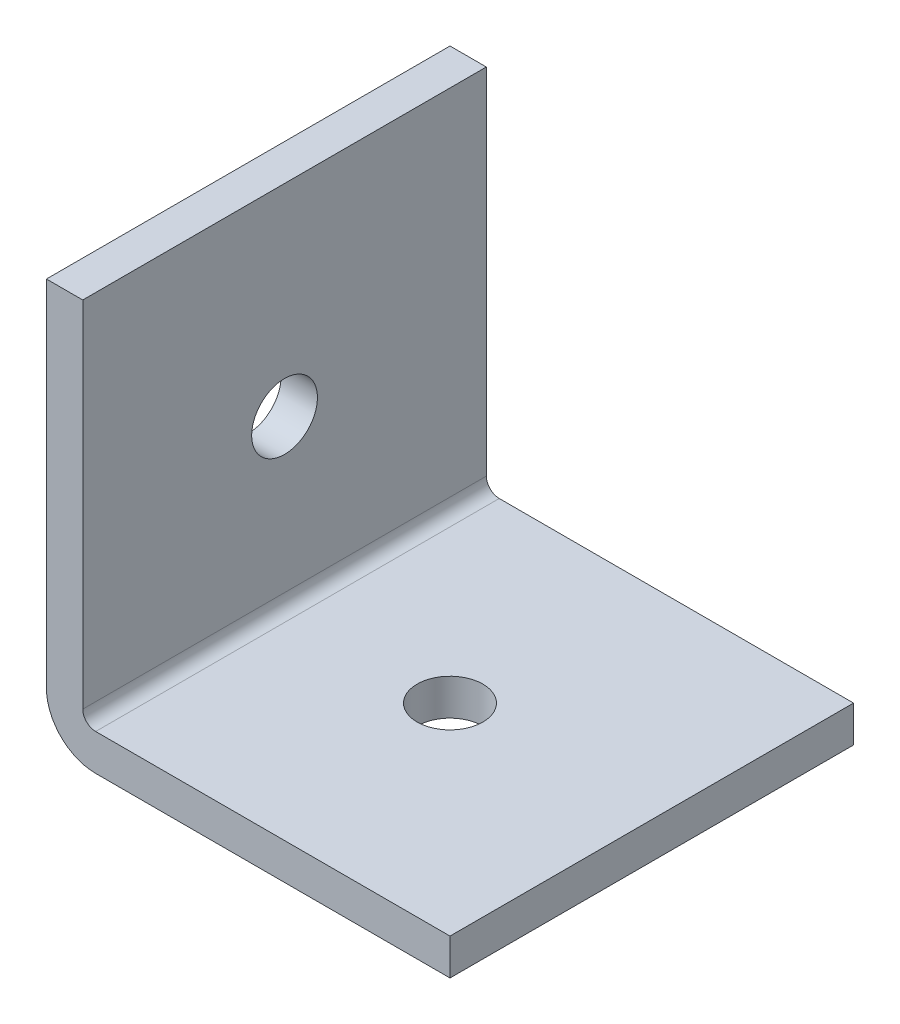
ISO-10303-21;
HEADER;
FILE_DESCRIPTION(('STEP AP214'),'2;1');
FILE_NAME('part.step','',(''),(''),'','','');
FILE_SCHEMA(('AUTOMOTIVE_DESIGN { 1 0 10303 214 1 1 1 1 }'));
ENDSEC;
DATA;
#1=APPLICATION_CONTEXT('core data for automotive mechanical design processes');
#2=APPLICATION_PROTOCOL_DEFINITION('international standard','automotive_design',2000,#1);
#3=PRODUCT_CONTEXT('',#1,'mechanical');
#4=PRODUCT('Part','Part','',(#3));
#5=PRODUCT_RELATED_PRODUCT_CATEGORY('part','',(#4));
#6=PRODUCT_DEFINITION_FORMATION('','',#4);
#7=PRODUCT_DEFINITION_CONTEXT('part definition',#1,'design');
#8=PRODUCT_DEFINITION('design','',#6,#7);
#9=PRODUCT_DEFINITION_SHAPE('','',#8);
#10=(LENGTH_UNIT() NAMED_UNIT(*) SI_UNIT(.MILLI.,.METRE.));
#11=(NAMED_UNIT(*) PLANE_ANGLE_UNIT() SI_UNIT($,.RADIAN.));
#12=(NAMED_UNIT(*) SI_UNIT($,.STERADIAN.) SOLID_ANGLE_UNIT());
#13=UNCERTAINTY_MEASURE_WITH_UNIT(LENGTH_MEASURE(1.E-05),#10,'distance_accuracy_value','');
#14=(GEOMETRIC_REPRESENTATION_CONTEXT(3) GLOBAL_UNCERTAINTY_ASSIGNED_CONTEXT((#13)) GLOBAL_UNIT_ASSIGNED_CONTEXT((#10,
#11,#12)) REPRESENTATION_CONTEXT('',''));
#15=CARTESIAN_POINT('',(0.,0.,0.));
#16=DIRECTION('',(0.,0.,1.));
#17=DIRECTION('',(1.,0.,0.));
#18=AXIS2_PLACEMENT_3D('',#15,#16,#17);
#19=CARTESIAN_POINT('',(25.4,0.,-749.3));
#20=DIRECTION('',(0.,-1.,0.));
#21=DIRECTION('',(0.,0.,-1.));
#22=AXIS2_PLACEMENT_3D('',#19,#20,#21);
#23=PLANE('',#22);
#24=DIRECTION('',(1.,0.,0.));
#25=VECTOR('',#24,1.);
#26=CARTESIAN_POINT('',(25.4,0.,-647.7));
#27=LINE('',#26,#25);
#28=CARTESIAN_POINT('',(3.0988,0.,-647.7));
#29=VERTEX_POINT('',#28);
#30=CARTESIAN_POINT('',(25.4,0.,-647.7));
#31=VERTEX_POINT('',#30);
#32=EDGE_CURVE('E99',#29,#31,#27,.T.);
#33=ORIENTED_EDGE('',*,*,#32,.F.);
#34=DIRECTION('',(0.,0.,1.));
#35=VECTOR('',#34,1.);
#36=CARTESIAN_POINT('',(3.0988,0.,-749.3));
#37=LINE('',#36,#35);
#38=CARTESIAN_POINT('',(3.0988,0.,-673.1));
#39=VERTEX_POINT('',#38);
#40=EDGE_CURVE('E57',#29,#39,#37,.F.);
#41=ORIENTED_EDGE('',*,*,#40,.T.);
#42=DIRECTION('',(1.,0.,0.));
#43=VECTOR('',#42,1.);
#44=CARTESIAN_POINT('',(25.4,0.,-673.1));
#45=LINE('',#44,#43);
#46=CARTESIAN_POINT('',(25.4,0.,-673.1));
#47=VERTEX_POINT('',#46);
#48=EDGE_CURVE('E150',#39,#47,#45,.T.);
#49=ORIENTED_EDGE('',*,*,#48,.T.);
#50=DIRECTION('',(0.,0.,1.));
#51=VECTOR('',#50,1.);
#52=CARTESIAN_POINT('',(25.4,0.,-749.3));
#53=LINE('',#52,#51);
#54=EDGE_CURVE('E107',#47,#31,#53,.T.);
#55=ORIENTED_EDGE('',*,*,#54,.T.);
#56=EDGE_LOOP('',(#33,#41,#49,#55));
#57=FACE_BOUND('',#56,.T.);
#58=CARTESIAN_POINT('',(12.7,0.,-660.4));
#59=DIRECTION('',(0.,-1.,0.));
#60=DIRECTION('',(0.,0.,-1.));
#61=AXIS2_PLACEMENT_3D('',#58,#59,#60);
#62=CIRCLE('',#61,2.07009999999995);
#63=CARTESIAN_POINT('',(12.7,0.,-662.4701));
#64=VERTEX_POINT('',#63);
#65=EDGE_CURVE('E131',#64,#64,#62,.T.);
#66=ORIENTED_EDGE('',*,*,#65,.F.);
#67=EDGE_LOOP('',(#66));
#68=FACE_BOUND('',#67,.T.);
#69=ADVANCED_FACE('F35',(#57,#68),#23,.T.);
#70=CARTESIAN_POINT('',(25.4,25.4,749.3));
#71=DIRECTION('',(0.,1.,0.));
#72=DIRECTION('',(0.,0.,1.));
#73=AXIS2_PLACEMENT_3D('',#70,#71,#72);
#74=PLANE('',#73);
#75=DIRECTION('',(-1.,0.,0.));
#76=VECTOR('',#75,1.);
#77=CARTESIAN_POINT('',(25.4,25.4,-647.7));
#78=LINE('',#77,#76);
#79=CARTESIAN_POINT('',(2.286,25.4,-647.7));
#80=VERTEX_POINT('',#79);
#81=CARTESIAN_POINT('',(0.,25.4000000000002,-647.7));
#82=VERTEX_POINT('',#81);
#83=EDGE_CURVE('E109',#80,#82,#78,.T.);
#84=ORIENTED_EDGE('',*,*,#83,.F.);
#85=DIRECTION('',(0.,0.,-1.));
#86=VECTOR('',#85,1.);
#87=CARTESIAN_POINT('',(2.286,25.4,749.3));
#88=LINE('',#87,#86);
#89=CARTESIAN_POINT('',(2.286,25.4,-673.1));
#90=VERTEX_POINT('',#89);
#91=EDGE_CURVE('E123',#80,#90,#88,.T.);
#92=ORIENTED_EDGE('',*,*,#91,.T.);
#93=DIRECTION('',(-1.,0.,0.));
#94=VECTOR('',#93,1.);
#95=CARTESIAN_POINT('',(25.4,25.4,-673.1));
#96=LINE('',#95,#94);
#97=CARTESIAN_POINT('',(0.,25.4000000000002,-673.1));
#98=VERTEX_POINT('',#97);
#99=EDGE_CURVE('E152',#90,#98,#96,.T.);
#100=ORIENTED_EDGE('',*,*,#99,.T.);
#101=DIRECTION('',(0.,0.,-1.));
#102=VECTOR('',#101,1.);
#103=CARTESIAN_POINT('',(0.,25.4,749.3));
#104=LINE('',#103,#102);
#105=EDGE_CURVE('E121',#82,#98,#104,.T.);
#106=ORIENTED_EDGE('',*,*,#105,.F.);
#107=EDGE_LOOP('',(#84,#92,#100,#106));
#108=FACE_BOUND('',#107,.T.);
#109=ADVANCED_FACE('F177',(#108),#74,.T.);
#110=CARTESIAN_POINT('',(25.4,0.,0.));
#111=DIRECTION('',(-1.,0.,0.));
#112=DIRECTION('',(0.,0.,1.));
#113=AXIS2_PLACEMENT_3D('',#110,#111,#112);
#114=PLANE('',#113);
#115=DIRECTION('',(0.,0.,-1.));
#116=VECTOR('',#115,1.);
#117=CARTESIAN_POINT('',(25.4,2.286,749.3));
#118=LINE('',#117,#116);
#119=CARTESIAN_POINT('',(25.4,2.286,-647.7));
#120=VERTEX_POINT('',#119);
#121=CARTESIAN_POINT('',(25.4,2.286,-673.1));
#122=VERTEX_POINT('',#121);
#123=EDGE_CURVE('E125',#120,#122,#118,.T.);
#124=ORIENTED_EDGE('',*,*,#123,.F.);
#125=DIRECTION('',(0.,-1.,0.));
#126=VECTOR('',#125,1.);
#127=CARTESIAN_POINT('',(25.4,0.,-647.7));
#128=LINE('',#127,#126);
#129=EDGE_CURVE('E164',#120,#31,#128,.T.);
#130=ORIENTED_EDGE('',*,*,#129,.T.);
#131=ORIENTED_EDGE('',*,*,#54,.F.);
#132=DIRECTION('',(0.,-1.,0.));
#133=VECTOR('',#132,1.);
#134=CARTESIAN_POINT('',(25.4,0.,-673.1));
#135=LINE('',#134,#133);
#136=EDGE_CURVE('E145',#122,#47,#135,.T.);
#137=ORIENTED_EDGE('',*,*,#136,.F.);
#138=EDGE_LOOP('',(#124,#130,#131,#137));
#139=FACE_BOUND('',#138,.T.);
#140=ADVANCED_FACE('F195',(#139),#114,.F.);
#141=CARTESIAN_POINT('',(0.,0.,0.));
#142=DIRECTION('',(-1.,0.,0.));
#143=DIRECTION('',(0.,0.,1.));
#144=AXIS2_PLACEMENT_3D('',#141,#142,#143);
#145=PLANE('',#144);
#146=DIRECTION('',(0.,-1.,0.));
#147=VECTOR('',#146,1.);
#148=CARTESIAN_POINT('',(0.,0.,-647.7));
#149=LINE('',#148,#147);
#150=CARTESIAN_POINT('',(0.,3.0988,-647.7));
#151=VERTEX_POINT('',#150);
#152=EDGE_CURVE('E49',#82,#151,#149,.T.);
#153=ORIENTED_EDGE('',*,*,#152,.F.);
#154=ORIENTED_EDGE('',*,*,#105,.T.);
#155=DIRECTION('',(0.,-1.,0.));
#156=VECTOR('',#155,1.);
#157=CARTESIAN_POINT('',(0.,0.,-673.1));
#158=LINE('',#157,#156);
#159=CARTESIAN_POINT('',(0.,3.0988,-673.1));
#160=VERTEX_POINT('',#159);
#161=EDGE_CURVE('E155',#98,#160,#158,.T.);
#162=ORIENTED_EDGE('',*,*,#161,.T.);
#163=DIRECTION('',(0.,0.,1.));
#164=VECTOR('',#163,1.);
#165=CARTESIAN_POINT('',(0.,3.0988,0.));
#166=LINE('',#165,#164);
#167=EDGE_CURVE('E112',#160,#151,#166,.T.);
#168=ORIENTED_EDGE('',*,*,#167,.T.);
#169=EDGE_LOOP('',(#153,#154,#162,#168));
#170=FACE_BOUND('',#169,.T.);
#171=CARTESIAN_POINT('',(0.,12.7,-660.4));
#172=DIRECTION('',(-1.,0.,0.));
#173=DIRECTION('',(0.,0.,1.));
#174=AXIS2_PLACEMENT_3D('',#171,#172,#173);
#175=CIRCLE('',#174,2.07009999999995);
#176=CARTESIAN_POINT('',(0.,12.7,-658.3299));
#177=VERTEX_POINT('',#176);
#178=EDGE_CURVE('E137',#177,#177,#175,.T.);
#179=ORIENTED_EDGE('',*,*,#178,.F.);
#180=EDGE_LOOP('',(#179));
#181=FACE_BOUND('',#180,.T.);
#182=ADVANCED_FACE('F174',(#170,#181),#145,.T.);
#183=CARTESIAN_POINT('',(2.286,2.286,749.3));
#184=DIRECTION('',(-1.,0.,0.));
#185=DIRECTION('',(0.,0.,1.));
#186=AXIS2_PLACEMENT_3D('',#183,#184,#185);
#187=PLANE('',#186);
#188=CARTESIAN_POINT('',(2.286,12.7,-660.4));
#189=DIRECTION('',(-1.,0.,0.));
#190=DIRECTION('',(0.,0.,1.));
#191=AXIS2_PLACEMENT_3D('',#188,#189,#190);
#192=CIRCLE('',#191,2.07009999999995);
#193=CARTESIAN_POINT('',(2.286,12.7,-658.3299));
#194=VERTEX_POINT('',#193);
#195=EDGE_CURVE('E134',#194,#194,#192,.T.);
#196=ORIENTED_EDGE('',*,*,#195,.T.);
#197=EDGE_LOOP('',(#196));
#198=FACE_BOUND('',#197,.T.);
#199=ORIENTED_EDGE('',*,*,#91,.F.);
#200=DIRECTION('',(0.,-1.,0.));
#201=VECTOR('',#200,1.);
#202=CARTESIAN_POINT('',(2.286,2.286,-647.7));
#203=LINE('',#202,#201);
#204=CARTESIAN_POINT('',(2.286,3.0988,-647.7));
#205=VERTEX_POINT('',#204);
#206=EDGE_CURVE('E108',#80,#205,#203,.T.);
#207=ORIENTED_EDGE('',*,*,#206,.T.);
#208=DIRECTION('',(0.,0.,-1.));
#209=VECTOR('',#208,1.);
#210=CARTESIAN_POINT('',(2.286,3.0988,-749.3));
#211=LINE('',#210,#209);
#212=CARTESIAN_POINT('',(2.286,3.0988,-673.1));
#213=VERTEX_POINT('',#212);
#214=EDGE_CURVE('E119',#205,#213,#211,.T.);
#215=ORIENTED_EDGE('',*,*,#214,.T.);
#216=DIRECTION('',(0.,-1.,0.));
#217=VECTOR('',#216,1.);
#218=CARTESIAN_POINT('',(2.286,2.286,-673.1));
#219=LINE('',#218,#217);
#220=EDGE_CURVE('E147',#90,#213,#219,.T.);
#221=ORIENTED_EDGE('',*,*,#220,.F.);
#222=EDGE_LOOP('',(#199,#207,#215,#221));
#223=FACE_BOUND('',#222,.T.);
#224=ADVANCED_FACE('F184',(#198,#223),#187,.F.);
#225=CARTESIAN_POINT('',(25.4,2.286,749.3));
#226=DIRECTION('',(0.,-1.,0.));
#227=DIRECTION('',(0.,0.,-1.));
#228=AXIS2_PLACEMENT_3D('',#225,#226,#227);
#229=PLANE('',#228);
#230=CARTESIAN_POINT('',(12.7,2.286,-660.4));
#231=DIRECTION('',(0.,-1.,0.));
#232=DIRECTION('',(0.,0.,-1.));
#233=AXIS2_PLACEMENT_3D('',#230,#231,#232);
#234=CIRCLE('',#233,2.07009999999995);
#235=CARTESIAN_POINT('',(12.7,2.286,-662.4701));
#236=VERTEX_POINT('',#235);
#237=EDGE_CURVE('E127',#236,#236,#234,.T.);
#238=ORIENTED_EDGE('',*,*,#237,.T.);
#239=EDGE_LOOP('',(#238));
#240=FACE_BOUND('',#239,.T.);
#241=DIRECTION('',(0.,0.,-1.));
#242=VECTOR('',#241,1.);
#243=CARTESIAN_POINT('',(3.0988,2.286,749.3));
#244=LINE('',#243,#242);
#245=CARTESIAN_POINT('',(3.0988,2.286,-673.1));
#246=VERTEX_POINT('',#245);
#247=CARTESIAN_POINT('',(3.0988,2.286,-647.7));
#248=VERTEX_POINT('',#247);
#249=EDGE_CURVE('E114',#246,#248,#244,.F.);
#250=ORIENTED_EDGE('',*,*,#249,.T.);
#251=DIRECTION('',(1.,0.,0.));
#252=VECTOR('',#251,1.);
#253=CARTESIAN_POINT('',(25.4,2.286,-647.7));
#254=LINE('',#253,#252);
#255=EDGE_CURVE('E158',#248,#120,#254,.T.);
#256=ORIENTED_EDGE('',*,*,#255,.T.);
#257=ORIENTED_EDGE('',*,*,#123,.T.);
#258=DIRECTION('',(1.,0.,0.));
#259=VECTOR('',#258,1.);
#260=CARTESIAN_POINT('',(25.4,2.286,-673.1));
#261=LINE('',#260,#259);
#262=EDGE_CURVE('E140',#246,#122,#261,.T.);
#263=ORIENTED_EDGE('',*,*,#262,.F.);
#264=EDGE_LOOP('',(#250,#256,#257,#263));
#265=FACE_BOUND('',#264,.T.);
#266=ADVANCED_FACE('F192',(#240,#265),#229,.F.);
#267=CARTESIAN_POINT('',(3.0988,3.0988,749.3));
#268=DIRECTION('',(0.,0.,1.));
#269=DIRECTION('',(1.,0.,0.));
#270=AXIS2_PLACEMENT_3D('',#267,#268,#269);
#271=CYLINDRICAL_SURFACE('',#270,0.8128);
#272=ORIENTED_EDGE('',*,*,#214,.F.);
#273=CARTESIAN_POINT('',(3.0988,3.0988,-647.7));
#274=DIRECTION('',(0.,0.,-1.));
#275=DIRECTION('',(-1.,0.,0.));
#276=AXIS2_PLACEMENT_3D('',#273,#274,#275);
#277=CIRCLE('',#276,0.8128);
#278=EDGE_CURVE('E161',#205,#248,#277,.F.);
#279=ORIENTED_EDGE('',*,*,#278,.T.);
#280=ORIENTED_EDGE('',*,*,#249,.F.);
#281=CARTESIAN_POINT('',(3.0988,3.0988,-673.1));
#282=DIRECTION('',(0.,0.,-1.));
#283=DIRECTION('',(-1.,0.,0.));
#284=AXIS2_PLACEMENT_3D('',#281,#282,#283);
#285=CIRCLE('',#284,0.8128);
#286=EDGE_CURVE('E143',#213,#246,#285,.F.);
#287=ORIENTED_EDGE('',*,*,#286,.F.);
#288=EDGE_LOOP('',(#272,#279,#280,#287));
#289=FACE_BOUND('',#288,.T.);
#290=ADVANCED_FACE('F187',(#289),#271,.F.);
#291=CARTESIAN_POINT('',(3.0988,3.0988,0.));
#292=DIRECTION('',(0.,0.,1.));
#293=DIRECTION('',(1.,0.,0.));
#294=AXIS2_PLACEMENT_3D('',#291,#292,#293);
#295=CYLINDRICAL_SURFACE('',#294,3.0988);
#296=CARTESIAN_POINT('',(3.0988,3.0988,-647.7));
#297=DIRECTION('',(0.,0.,-1.));
#298=DIRECTION('',(-1.,0.,0.));
#299=AXIS2_PLACEMENT_3D('',#296,#297,#298);
#300=CIRCLE('',#299,3.0988);
#301=EDGE_CURVE('E11',#151,#29,#300,.F.);
#302=ORIENTED_EDGE('',*,*,#301,.F.);
#303=ORIENTED_EDGE('',*,*,#167,.F.);
#304=CARTESIAN_POINT('',(3.0988,3.0988,-673.1));
#305=DIRECTION('',(0.,0.,-1.));
#306=DIRECTION('',(-1.,0.,0.));
#307=AXIS2_PLACEMENT_3D('',#304,#305,#306);
#308=CIRCLE('',#307,3.0988);
#309=EDGE_CURVE('E43',#160,#39,#308,.F.);
#310=ORIENTED_EDGE('',*,*,#309,.T.);
#311=ORIENTED_EDGE('',*,*,#40,.F.);
#312=EDGE_LOOP('',(#302,#303,#310,#311));
#313=FACE_BOUND('',#312,.T.);
#314=ADVANCED_FACE('F37',(#313),#295,.T.);
#315=CARTESIAN_POINT('',(12.7,0.,-660.4));
#316=DIRECTION('',(0.,-1.,0.));
#317=DIRECTION('',(0.,0.,-1.));
#318=AXIS2_PLACEMENT_3D('',#315,#316,#317);
#319=CYLINDRICAL_SURFACE('',#318,2.07009999999995);
#320=ORIENTED_EDGE('',*,*,#65,.T.);
#321=EDGE_LOOP('',(#320));
#322=FACE_BOUND('',#321,.T.);
#323=ORIENTED_EDGE('',*,*,#237,.F.);
#324=EDGE_LOOP('',(#323));
#325=FACE_BOUND('',#324,.T.);
#326=ADVANCED_FACE('F215',(#322,#325),#319,.F.);
#327=CARTESIAN_POINT('',(0.,12.7,-660.4));
#328=DIRECTION('',(-1.,0.,0.));
#329=DIRECTION('',(0.,0.,1.));
#330=AXIS2_PLACEMENT_3D('',#327,#328,#329);
#331=CYLINDRICAL_SURFACE('',#330,2.07009999999995);
#332=ORIENTED_EDGE('',*,*,#178,.T.);
#333=EDGE_LOOP('',(#332));
#334=FACE_BOUND('',#333,.T.);
#335=ORIENTED_EDGE('',*,*,#195,.F.);
#336=EDGE_LOOP('',(#335));
#337=FACE_BOUND('',#336,.T.);
#338=ADVANCED_FACE('F225',(#334,#337),#331,.F.);
#339=CARTESIAN_POINT('',(0.,0.,-673.1));
#340=DIRECTION('',(0.,0.,-1.));
#341=DIRECTION('',(-1.,0.,0.));
#342=AXIS2_PLACEMENT_3D('',#339,#340,#341);
#343=PLANE('',#342);
#344=ORIENTED_EDGE('',*,*,#262,.T.);
#345=ORIENTED_EDGE('',*,*,#136,.T.);
#346=ORIENTED_EDGE('',*,*,#48,.F.);
#347=ORIENTED_EDGE('',*,*,#309,.F.);
#348=ORIENTED_EDGE('',*,*,#161,.F.);
#349=ORIENTED_EDGE('',*,*,#99,.F.);
#350=ORIENTED_EDGE('',*,*,#220,.T.);
#351=ORIENTED_EDGE('',*,*,#286,.T.);
#352=EDGE_LOOP('',(#344,#345,#346,#347,#348,#349,#350,#351));
#353=FACE_BOUND('',#352,.T.);
#354=ADVANCED_FACE('F181',(#353),#343,.T.);
#355=CARTESIAN_POINT('',(0.,0.,-647.7));
#356=DIRECTION('',(0.,0.,-1.));
#357=DIRECTION('',(-1.,0.,0.));
#358=AXIS2_PLACEMENT_3D('',#355,#356,#357);
#359=PLANE('',#358);
#360=ORIENTED_EDGE('',*,*,#278,.F.);
#361=ORIENTED_EDGE('',*,*,#206,.F.);
#362=ORIENTED_EDGE('',*,*,#83,.T.);
#363=ORIENTED_EDGE('',*,*,#152,.T.);
#364=ORIENTED_EDGE('',*,*,#301,.T.);
#365=ORIENTED_EDGE('',*,*,#32,.T.);
#366=ORIENTED_EDGE('',*,*,#129,.F.);
#367=ORIENTED_EDGE('',*,*,#255,.F.);
#368=EDGE_LOOP('',(#360,#361,#362,#363,#364,#365,#366,#367));
#369=FACE_BOUND('',#368,.T.);
#370=ADVANCED_FACE('F98',(#369),#359,.F.);
#371=CLOSED_SHELL('',(#69,#109,#140,#182,#224,#266,#290,#314,#326,#338,#354,#370));
#372=MANIFOLD_SOLID_BREP('B2',#371);
#373=ADVANCED_BREP_SHAPE_REPRESENTATION('',(#18,#372),#14);
#374=SHAPE_DEFINITION_REPRESENTATION(#9,#373);
ENDSEC;
END-ISO-10303-21;
